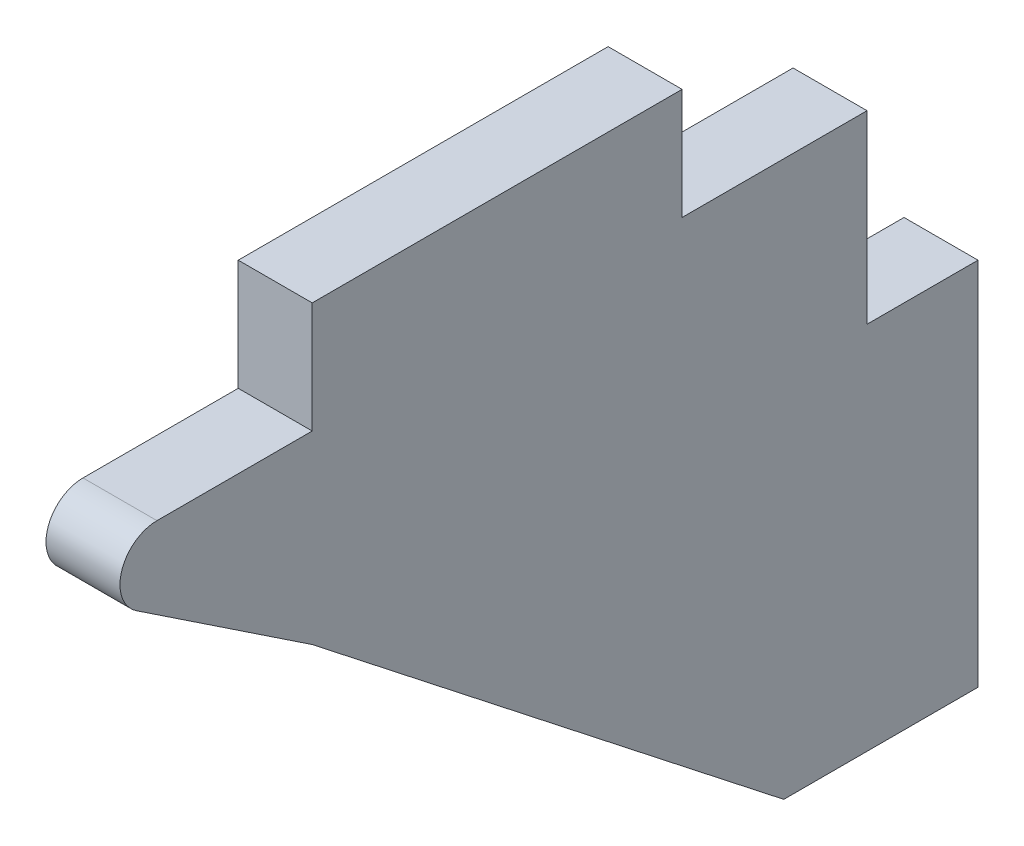
ISO-10303-21;
HEADER;
FILE_DESCRIPTION(('STEP AP214'),'2;1');
FILE_NAME('part.step','',(''),(''),'','','');
FILE_SCHEMA(('AUTOMOTIVE_DESIGN { 1 0 10303 214 1 1 1 1 }'));
ENDSEC;
DATA;
#1=APPLICATION_CONTEXT('core data for automotive mechanical design processes');
#2=APPLICATION_PROTOCOL_DEFINITION('international standard','automotive_design',2000,#1);
#3=PRODUCT_CONTEXT('',#1,'mechanical');
#4=PRODUCT('Part','Part','',(#3));
#5=PRODUCT_RELATED_PRODUCT_CATEGORY('part','',(#4));
#6=PRODUCT_DEFINITION_FORMATION('','',#4);
#7=PRODUCT_DEFINITION_CONTEXT('part definition',#1,'design');
#8=PRODUCT_DEFINITION('design','',#6,#7);
#9=PRODUCT_DEFINITION_SHAPE('','',#8);
#10=(LENGTH_UNIT() NAMED_UNIT(*) SI_UNIT(.MILLI.,.METRE.));
#11=(NAMED_UNIT(*) PLANE_ANGLE_UNIT() SI_UNIT($,.RADIAN.));
#12=(NAMED_UNIT(*) SI_UNIT($,.STERADIAN.) SOLID_ANGLE_UNIT());
#13=UNCERTAINTY_MEASURE_WITH_UNIT(LENGTH_MEASURE(1.E-05),#10,'distance_accuracy_value','');
#14=(GEOMETRIC_REPRESENTATION_CONTEXT(3) GLOBAL_UNCERTAINTY_ASSIGNED_CONTEXT((#13)) GLOBAL_UNIT_ASSIGNED_CONTEXT((#10,
#11,#12)) REPRESENTATION_CONTEXT('',''));
#15=CARTESIAN_POINT('',(0.,0.,0.));
#16=DIRECTION('',(0.,0.,1.));
#17=DIRECTION('',(1.,0.,0.));
#18=AXIS2_PLACEMENT_3D('',#15,#16,#17);
#19=CARTESIAN_POINT('',(1.,-1.,19.197224362268));
#20=DIRECTION('',(-1.,0.,0.));
#21=DIRECTION('',(0.,0.,1.));
#22=AXIS2_PLACEMENT_3D('',#19,#20,#21);
#23=CYLINDRICAL_SURFACE('',#22,1.);
#24=CARTESIAN_POINT('',(-1.,-1.,19.197224362268));
#25=DIRECTION('',(-1.,0.,0.));
#26=DIRECTION('',(0.,0.,1.));
#27=AXIS2_PLACEMENT_3D('',#24,#25,#26);
#28=CIRCLE('',#27,1.);
#29=CARTESIAN_POINT('',(-1.,0.,19.197224362268));
#30=VERTEX_POINT('',#29);
#31=CARTESIAN_POINT('',(-1.,-1.83205029433784,19.7519245584932));
#32=VERTEX_POINT('',#31);
#33=EDGE_CURVE('E20',#30,#32,#28,.F.);
#34=ORIENTED_EDGE('',*,*,#33,.T.);
#35=DIRECTION('',(1.,0.,0.));
#36=VECTOR('',#35,1.);
#37=CARTESIAN_POINT('',(1.,-1.83205029433784,19.7519245584932));
#38=LINE('',#37,#36);
#39=CARTESIAN_POINT('',(1.,-1.83205029433784,19.7519245584932));
#40=VERTEX_POINT('',#39);
#41=EDGE_CURVE('E121',#32,#40,#38,.T.);
#42=ORIENTED_EDGE('',*,*,#41,.T.);
#43=CARTESIAN_POINT('',(1.,-1.,19.197224362268));
#44=DIRECTION('',(-1.,0.,0.));
#45=DIRECTION('',(0.,0.,1.));
#46=AXIS2_PLACEMENT_3D('',#43,#44,#45);
#47=CIRCLE('',#46,1.);
#48=CARTESIAN_POINT('',(1.,0.,19.197224362268));
#49=VERTEX_POINT('',#48);
#50=EDGE_CURVE('E226',#49,#40,#47,.F.);
#51=ORIENTED_EDGE('',*,*,#50,.F.);
#52=DIRECTION('',(1.,0.,0.));
#53=VECTOR('',#52,1.);
#54=CARTESIAN_POINT('',(1.,0.,19.197224362268));
#55=LINE('',#54,#53);
#56=EDGE_CURVE('E122',#49,#30,#55,.F.);
#57=ORIENTED_EDGE('',*,*,#56,.T.);
#58=EDGE_LOOP('',(#34,#42,#51,#57));
#59=FACE_BOUND('',#58,.T.);
#60=ADVANCED_FACE('F17',(#59),#23,.T.);
#61=CARTESIAN_POINT('',(1.,0.,0.));
#62=DIRECTION('',(1.,0.,0.));
#63=DIRECTION('',(0.,0.,-1.));
#64=AXIS2_PLACEMENT_3D('',#61,#62,#63);
#65=PLANE('',#64);
#66=DIRECTION('',(0.,0.,1.));
#67=VECTOR('',#66,1.);
#68=CARTESIAN_POINT('',(1.,3.,0.));
#69=LINE('',#68,#67);
#70=CARTESIAN_POINT('',(1.,3.,15.));
#71=VERTEX_POINT('',#70);
#72=CARTESIAN_POINT('',(1.,3.,5.));
#73=VERTEX_POINT('',#72);
#74=EDGE_CURVE('E160',#71,#73,#69,.F.);
#75=ORIENTED_EDGE('',*,*,#74,.F.);
#76=DIRECTION('',(0.,1.,0.));
#77=VECTOR('',#76,1.);
#78=CARTESIAN_POINT('',(1.,0.,15.));
#79=LINE('',#78,#77);
#80=CARTESIAN_POINT('',(1.,0.,15.));
#81=VERTEX_POINT('',#80);
#82=EDGE_CURVE('E150',#81,#71,#79,.T.);
#83=ORIENTED_EDGE('',*,*,#82,.F.);
#84=DIRECTION('',(0.,0.,-1.));
#85=VECTOR('',#84,1.);
#86=CARTESIAN_POINT('',(1.,0.,0.));
#87=LINE('',#86,#85);
#88=EDGE_CURVE('E136',#81,#49,#87,.F.);
#89=ORIENTED_EDGE('',*,*,#88,.T.);
#90=ORIENTED_EDGE('',*,*,#50,.T.);
#91=DIRECTION('',(0.,0.554700196225229,0.832050294337844));
#92=VECTOR('',#91,1.);
#93=CARTESIAN_POINT('',(1.,-10.3846153846154,6.92307692307692));
#94=LINE('',#93,#92);
#95=CARTESIAN_POINT('',(1.,-5.,15.));
#96=VERTEX_POINT('',#95);
#97=EDGE_CURVE('E112',#40,#96,#94,.F.);
#98=ORIENTED_EDGE('',*,*,#97,.T.);
#99=DIRECTION('',(0.,-0.617139935181102,-0.786853417355905));
#100=VECTOR('',#99,1.);
#101=CARTESIAN_POINT('',(1.,-10.3796715067841,8.14091882885027));
#102=LINE('',#101,#100);
#103=CARTESIAN_POINT('',(1.,-15.,2.25));
#104=VERTEX_POINT('',#103);
#105=EDGE_CURVE('E117',#104,#96,#102,.F.);
#106=ORIENTED_EDGE('',*,*,#105,.F.);
#107=DIRECTION('',(0.,0.,1.));
#108=VECTOR('',#107,1.);
#109=CARTESIAN_POINT('',(1.,-15.,0.));
#110=LINE('',#109,#108);
#111=CARTESIAN_POINT('',(1.,-15.,-3.));
#112=VERTEX_POINT('',#111);
#113=EDGE_CURVE('E213',#104,#112,#110,.F.);
#114=ORIENTED_EDGE('',*,*,#113,.T.);
#115=DIRECTION('',(0.,1.,0.));
#116=VECTOR('',#115,1.);
#117=CARTESIAN_POINT('',(1.,0.,-3.));
#118=LINE('',#117,#116);
#119=CARTESIAN_POINT('',(1.,-5.,-3.));
#120=VERTEX_POINT('',#119);
#121=EDGE_CURVE('E212',#112,#120,#118,.T.);
#122=ORIENTED_EDGE('',*,*,#121,.T.);
#123=DIRECTION('',(0.,0.,1.));
#124=VECTOR('',#123,1.);
#125=CARTESIAN_POINT('',(1.,-5.,0.));
#126=LINE('',#125,#124);
#127=CARTESIAN_POINT('',(1.,-5.,0.));
#128=VERTEX_POINT('',#127);
#129=EDGE_CURVE('E202',#128,#120,#126,.F.);
#130=ORIENTED_EDGE('',*,*,#129,.F.);
#131=DIRECTION('',(0.,1.,0.));
#132=VECTOR('',#131,1.);
#133=CARTESIAN_POINT('',(1.,0.,0.));
#134=LINE('',#133,#132);
#135=CARTESIAN_POINT('',(1.,0.,0.));
#136=VERTEX_POINT('',#135);
#137=EDGE_CURVE('E192',#136,#128,#134,.F.);
#138=ORIENTED_EDGE('',*,*,#137,.F.);
#139=DIRECTION('',(0.,0.,-1.));
#140=VECTOR('',#139,1.);
#141=CARTESIAN_POINT('',(1.,0.,0.));
#142=LINE('',#141,#140);
#143=CARTESIAN_POINT('',(1.,0.,5.));
#144=VERTEX_POINT('',#143);
#145=EDGE_CURVE('E172',#136,#144,#142,.F.);
#146=ORIENTED_EDGE('',*,*,#145,.T.);
#147=DIRECTION('',(0.,1.,0.));
#148=VECTOR('',#147,1.);
#149=CARTESIAN_POINT('',(1.,0.,5.));
#150=LINE('',#149,#148);
#151=EDGE_CURVE('E171',#144,#73,#150,.T.);
#152=ORIENTED_EDGE('',*,*,#151,.T.);
#153=EDGE_LOOP('',(#75,#83,#89,#90,#98,#106,#114,#122,#130,#138,#146,#152));
#154=FACE_BOUND('',#153,.T.);
#155=ADVANCED_FACE('F260',(#154),#65,.T.);
#156=CARTESIAN_POINT('',(1.,-10.3796715067841,8.14091882885027));
#157=DIRECTION('',(0.,-0.786853417355905,0.617139935181102));
#158=DIRECTION('',(0.,-0.617139935181102,-0.786853417355905));
#159=AXIS2_PLACEMENT_3D('',#156,#157,#158);
#160=PLANE('',#159);
#161=ORIENTED_EDGE('',*,*,#105,.T.);
#162=DIRECTION('',(1.,0.,0.));
#163=VECTOR('',#162,1.);
#164=CARTESIAN_POINT('',(1.,-5.,15.));
#165=LINE('',#164,#163);
#166=CARTESIAN_POINT('',(-1.,-4.99999999999988,15.0000000000002));
#167=VERTEX_POINT('',#166);
#168=EDGE_CURVE('E115',#96,#167,#165,.F.);
#169=ORIENTED_EDGE('',*,*,#168,.T.);
#170=DIRECTION('',(0.,-0.617139935181102,-0.786853417355905));
#171=VECTOR('',#170,1.);
#172=CARTESIAN_POINT('',(-1.,-5.,15.));
#173=LINE('',#172,#171);
#174=CARTESIAN_POINT('',(-1.,-15.,2.25));
#175=VERTEX_POINT('',#174);
#176=EDGE_CURVE('E104',#167,#175,#173,.T.);
#177=ORIENTED_EDGE('',*,*,#176,.T.);
#178=DIRECTION('',(1.,0.,0.));
#179=VECTOR('',#178,1.);
#180=CARTESIAN_POINT('',(1.,-15.,2.25));
#181=LINE('',#180,#179);
#182=EDGE_CURVE('E219',#175,#104,#181,.T.);
#183=ORIENTED_EDGE('',*,*,#182,.T.);
#184=EDGE_LOOP('',(#161,#169,#177,#183));
#185=FACE_BOUND('',#184,.T.);
#186=ADVANCED_FACE('F116',(#185),#160,.T.);
#187=CARTESIAN_POINT('',(1.,-15.,0.));
#188=DIRECTION('',(0.,1.,0.));
#189=DIRECTION('',(0.,0.,1.));
#190=AXIS2_PLACEMENT_3D('',#187,#188,#189);
#191=PLANE('',#190);
#192=DIRECTION('',(1.,0.,0.));
#193=VECTOR('',#192,1.);
#194=CARTESIAN_POINT('',(1.,-15.,-3.));
#195=LINE('',#194,#193);
#196=CARTESIAN_POINT('',(-1.,-15.,-3.));
#197=VERTEX_POINT('',#196);
#198=EDGE_CURVE('E209',#197,#112,#195,.T.);
#199=ORIENTED_EDGE('',*,*,#198,.T.);
#200=ORIENTED_EDGE('',*,*,#113,.F.);
#201=ORIENTED_EDGE('',*,*,#182,.F.);
#202=DIRECTION('',(0.,0.,-1.));
#203=VECTOR('',#202,1.);
#204=CARTESIAN_POINT('',(-1.,-15.,0.));
#205=LINE('',#204,#203);
#206=EDGE_CURVE('E109',#175,#197,#205,.T.);
#207=ORIENTED_EDGE('',*,*,#206,.T.);
#208=EDGE_LOOP('',(#199,#200,#201,#207));
#209=FACE_BOUND('',#208,.T.);
#210=ADVANCED_FACE('F299',(#209),#191,.F.);
#211=CARTESIAN_POINT('',(1.,0.,-3.));
#212=DIRECTION('',(0.,0.,1.));
#213=DIRECTION('',(1.,0.,0.));
#214=AXIS2_PLACEMENT_3D('',#211,#212,#213);
#215=PLANE('',#214);
#216=DIRECTION('',(1.,0.,0.));
#217=VECTOR('',#216,1.);
#218=CARTESIAN_POINT('',(1.,-5.,-3.));
#219=LINE('',#218,#217);
#220=CARTESIAN_POINT('',(-1.,-5.,-3.));
#221=VERTEX_POINT('',#220);
#222=EDGE_CURVE('E200',#120,#221,#219,.F.);
#223=ORIENTED_EDGE('',*,*,#222,.F.);
#224=ORIENTED_EDGE('',*,*,#121,.F.);
#225=ORIENTED_EDGE('',*,*,#198,.F.);
#226=DIRECTION('',(0.,1.,0.));
#227=VECTOR('',#226,1.);
#228=CARTESIAN_POINT('',(-1.,0.,-3.));
#229=LINE('',#228,#227);
#230=EDGE_CURVE('E197',#197,#221,#229,.T.);
#231=ORIENTED_EDGE('',*,*,#230,.T.);
#232=EDGE_LOOP('',(#223,#224,#225,#231));
#233=FACE_BOUND('',#232,.T.);
#234=ADVANCED_FACE('F295',(#233),#215,.F.);
#235=CARTESIAN_POINT('',(1.,-5.,0.));
#236=DIRECTION('',(0.,1.,0.));
#237=DIRECTION('',(0.,0.,1.));
#238=AXIS2_PLACEMENT_3D('',#235,#236,#237);
#239=PLANE('',#238);
#240=ORIENTED_EDGE('',*,*,#129,.T.);
#241=ORIENTED_EDGE('',*,*,#222,.T.);
#242=DIRECTION('',(0.,0.,-1.));
#243=VECTOR('',#242,1.);
#244=CARTESIAN_POINT('',(-1.,-5.,0.));
#245=LINE('',#244,#243);
#246=CARTESIAN_POINT('',(-1.,-5.,0.));
#247=VERTEX_POINT('',#246);
#248=EDGE_CURVE('E188',#221,#247,#245,.F.);
#249=ORIENTED_EDGE('',*,*,#248,.T.);
#250=DIRECTION('',(1.,0.,0.));
#251=VECTOR('',#250,1.);
#252=CARTESIAN_POINT('',(1.,-5.,0.));
#253=LINE('',#252,#251);
#254=EDGE_CURVE('E183',#128,#247,#253,.F.);
#255=ORIENTED_EDGE('',*,*,#254,.F.);
#256=EDGE_LOOP('',(#240,#241,#249,#255));
#257=FACE_BOUND('',#256,.T.);
#258=ADVANCED_FACE('F292',(#257),#239,.T.);
#259=CARTESIAN_POINT('',(1.,0.,0.));
#260=DIRECTION('',(0.,0.,-1.));
#261=DIRECTION('',(0.,1.,0.));
#262=AXIS2_PLACEMENT_3D('',#259,#260,#261);
#263=PLANE('',#262);
#264=ORIENTED_EDGE('',*,*,#137,.T.);
#265=ORIENTED_EDGE('',*,*,#254,.T.);
#266=DIRECTION('',(0.,1.,0.));
#267=VECTOR('',#266,1.);
#268=CARTESIAN_POINT('',(-1.,0.,0.));
#269=LINE('',#268,#267);
#270=CARTESIAN_POINT('',(-1.,0.,0.));
#271=VERTEX_POINT('',#270);
#272=EDGE_CURVE('E177',#247,#271,#269,.T.);
#273=ORIENTED_EDGE('',*,*,#272,.T.);
#274=DIRECTION('',(1.,0.,0.));
#275=VECTOR('',#274,1.);
#276=CARTESIAN_POINT('',(1.,0.,0.));
#277=LINE('',#276,#275);
#278=EDGE_CURVE('E180',#271,#136,#277,.T.);
#279=ORIENTED_EDGE('',*,*,#278,.T.);
#280=EDGE_LOOP('',(#264,#265,#273,#279));
#281=FACE_BOUND('',#280,.T.);
#282=ADVANCED_FACE('F288',(#281),#263,.T.);
#283=CARTESIAN_POINT('',(1.,0.,0.));
#284=DIRECTION('',(0.,-1.,0.));
#285=DIRECTION('',(0.,0.,-1.));
#286=AXIS2_PLACEMENT_3D('',#283,#284,#285);
#287=PLANE('',#286);
#288=DIRECTION('',(1.,0.,0.));
#289=VECTOR('',#288,1.);
#290=CARTESIAN_POINT('',(1.,0.,5.));
#291=LINE('',#290,#289);
#292=CARTESIAN_POINT('',(-1.,0.,5.));
#293=VERTEX_POINT('',#292);
#294=EDGE_CURVE('E168',#293,#144,#291,.T.);
#295=ORIENTED_EDGE('',*,*,#294,.T.);
#296=ORIENTED_EDGE('',*,*,#145,.F.);
#297=ORIENTED_EDGE('',*,*,#278,.F.);
#298=DIRECTION('',(0.,0.,-1.));
#299=VECTOR('',#298,1.);
#300=CARTESIAN_POINT('',(-1.,0.,0.));
#301=LINE('',#300,#299);
#302=EDGE_CURVE('E165',#271,#293,#301,.F.);
#303=ORIENTED_EDGE('',*,*,#302,.T.);
#304=EDGE_LOOP('',(#295,#296,#297,#303));
#305=FACE_BOUND('',#304,.T.);
#306=ADVANCED_FACE('F284',(#305),#287,.F.);
#307=CARTESIAN_POINT('',(1.,0.,5.));
#308=DIRECTION('',(0.,0.,1.));
#309=DIRECTION('',(1.,0.,0.));
#310=AXIS2_PLACEMENT_3D('',#307,#308,#309);
#311=PLANE('',#310);
#312=DIRECTION('',(1.,0.,0.));
#313=VECTOR('',#312,1.);
#314=CARTESIAN_POINT('',(1.,3.,5.));
#315=LINE('',#314,#313);
#316=CARTESIAN_POINT('',(-1.,3.,5.));
#317=VERTEX_POINT('',#316);
#318=EDGE_CURVE('E158',#73,#317,#315,.F.);
#319=ORIENTED_EDGE('',*,*,#318,.F.);
#320=ORIENTED_EDGE('',*,*,#151,.F.);
#321=ORIENTED_EDGE('',*,*,#294,.F.);
#322=DIRECTION('',(0.,1.,0.));
#323=VECTOR('',#322,1.);
#324=CARTESIAN_POINT('',(-1.,0.,5.));
#325=LINE('',#324,#323);
#326=EDGE_CURVE('E155',#293,#317,#325,.T.);
#327=ORIENTED_EDGE('',*,*,#326,.T.);
#328=EDGE_LOOP('',(#319,#320,#321,#327));
#329=FACE_BOUND('',#328,.T.);
#330=ADVANCED_FACE('F280',(#329),#311,.F.);
#331=CARTESIAN_POINT('',(1.,3.,0.));
#332=DIRECTION('',(0.,1.,0.));
#333=DIRECTION('',(0.,0.,1.));
#334=AXIS2_PLACEMENT_3D('',#331,#332,#333);
#335=PLANE('',#334);
#336=ORIENTED_EDGE('',*,*,#74,.T.);
#337=ORIENTED_EDGE('',*,*,#318,.T.);
#338=DIRECTION('',(0.,0.,-1.));
#339=VECTOR('',#338,1.);
#340=CARTESIAN_POINT('',(-1.,3.,0.));
#341=LINE('',#340,#339);
#342=CARTESIAN_POINT('',(-1.,3.,15.));
#343=VERTEX_POINT('',#342);
#344=EDGE_CURVE('E146',#317,#343,#341,.F.);
#345=ORIENTED_EDGE('',*,*,#344,.T.);
#346=DIRECTION('',(1.,0.,0.));
#347=VECTOR('',#346,1.);
#348=CARTESIAN_POINT('',(1.,3.,15.));
#349=LINE('',#348,#347);
#350=EDGE_CURVE('E140',#71,#343,#349,.F.);
#351=ORIENTED_EDGE('',*,*,#350,.F.);
#352=EDGE_LOOP('',(#336,#337,#345,#351));
#353=FACE_BOUND('',#352,.T.);
#354=ADVANCED_FACE('F275',(#353),#335,.T.);
#355=CARTESIAN_POINT('',(1.,0.,15.));
#356=DIRECTION('',(0.,0.,1.));
#357=DIRECTION('',(1.,0.,0.));
#358=AXIS2_PLACEMENT_3D('',#355,#356,#357);
#359=PLANE('',#358);
#360=ORIENTED_EDGE('',*,*,#82,.T.);
#361=ORIENTED_EDGE('',*,*,#350,.T.);
#362=DIRECTION('',(0.,1.,0.));
#363=VECTOR('',#362,1.);
#364=CARTESIAN_POINT('',(-1.,0.,15.));
#365=LINE('',#364,#363);
#366=CARTESIAN_POINT('',(-1.,0.,15.));
#367=VERTEX_POINT('',#366);
#368=EDGE_CURVE('E143',#343,#367,#365,.F.);
#369=ORIENTED_EDGE('',*,*,#368,.T.);
#370=DIRECTION('',(1.,0.,0.));
#371=VECTOR('',#370,1.);
#372=CARTESIAN_POINT('',(1.,0.,15.));
#373=LINE('',#372,#371);
#374=EDGE_CURVE('E137',#367,#81,#373,.T.);
#375=ORIENTED_EDGE('',*,*,#374,.T.);
#376=EDGE_LOOP('',(#360,#361,#369,#375));
#377=FACE_BOUND('',#376,.T.);
#378=ADVANCED_FACE('F272',(#377),#359,.T.);
#379=CARTESIAN_POINT('',(1.,0.,0.));
#380=DIRECTION('',(0.,-1.,0.));
#381=DIRECTION('',(0.,0.,-1.));
#382=AXIS2_PLACEMENT_3D('',#379,#380,#381);
#383=PLANE('',#382);
#384=ORIENTED_EDGE('',*,*,#56,.F.);
#385=ORIENTED_EDGE('',*,*,#88,.F.);
#386=ORIENTED_EDGE('',*,*,#374,.F.);
#387=DIRECTION('',(0.,0.,-1.));
#388=VECTOR('',#387,1.);
#389=CARTESIAN_POINT('',(-1.,0.,0.));
#390=LINE('',#389,#388);
#391=EDGE_CURVE('E26',#367,#30,#390,.F.);
#392=ORIENTED_EDGE('',*,*,#391,.T.);
#393=EDGE_LOOP('',(#384,#385,#386,#392));
#394=FACE_BOUND('',#393,.T.);
#395=ADVANCED_FACE('F265',(#394),#383,.F.);
#396=CARTESIAN_POINT('',(1.,-10.3846153846154,6.92307692307692));
#397=DIRECTION('',(0.,0.832050294337844,-0.554700196225229));
#398=DIRECTION('',(0.,0.554700196225229,0.832050294337844));
#399=AXIS2_PLACEMENT_3D('',#396,#397,#398);
#400=PLANE('',#399);
#401=ORIENTED_EDGE('',*,*,#41,.F.);
#402=DIRECTION('',(0.,-0.554700196225228,-0.832050294337844));
#403=VECTOR('',#402,1.);
#404=CARTESIAN_POINT('',(-1.,-1.83205029433784,19.7519245584932));
#405=LINE('',#404,#403);
#406=EDGE_CURVE('E11',#32,#167,#405,.T.);
#407=ORIENTED_EDGE('',*,*,#406,.T.);
#408=ORIENTED_EDGE('',*,*,#168,.F.);
#409=ORIENTED_EDGE('',*,*,#97,.F.);
#410=EDGE_LOOP('',(#401,#407,#408,#409));
#411=FACE_BOUND('',#410,.T.);
#412=ADVANCED_FACE('F124',(#411),#400,.F.);
#413=CARTESIAN_POINT('',(-1.,0.,0.));
#414=DIRECTION('',(1.,0.,0.));
#415=DIRECTION('',(0.,0.,-1.));
#416=AXIS2_PLACEMENT_3D('',#413,#414,#415);
#417=PLANE('',#416);
#418=ORIENTED_EDGE('',*,*,#33,.F.);
#419=ORIENTED_EDGE('',*,*,#391,.F.);
#420=ORIENTED_EDGE('',*,*,#368,.F.);
#421=ORIENTED_EDGE('',*,*,#344,.F.);
#422=ORIENTED_EDGE('',*,*,#326,.F.);
#423=ORIENTED_EDGE('',*,*,#302,.F.);
#424=ORIENTED_EDGE('',*,*,#272,.F.);
#425=ORIENTED_EDGE('',*,*,#248,.F.);
#426=ORIENTED_EDGE('',*,*,#230,.F.);
#427=ORIENTED_EDGE('',*,*,#206,.F.);
#428=ORIENTED_EDGE('',*,*,#176,.F.);
#429=ORIENTED_EDGE('',*,*,#406,.F.);
#430=EDGE_LOOP('',(#418,#419,#420,#421,#422,#423,#424,#425,#426,#427,#428,#429));
#431=FACE_BOUND('',#430,.T.);
#432=ADVANCED_FACE('F106',(#431),#417,.F.);
#433=CLOSED_SHELL('',(#60,#155,#186,#210,#234,#258,#282,#306,#330,#354,#378,#395,#412,#432));
#434=MANIFOLD_SOLID_BREP('B1',#433);
#435=ADVANCED_BREP_SHAPE_REPRESENTATION('',(#18,#434),#14);
#436=SHAPE_DEFINITION_REPRESENTATION(#9,#435);
ENDSEC;
END-ISO-10303-21;
